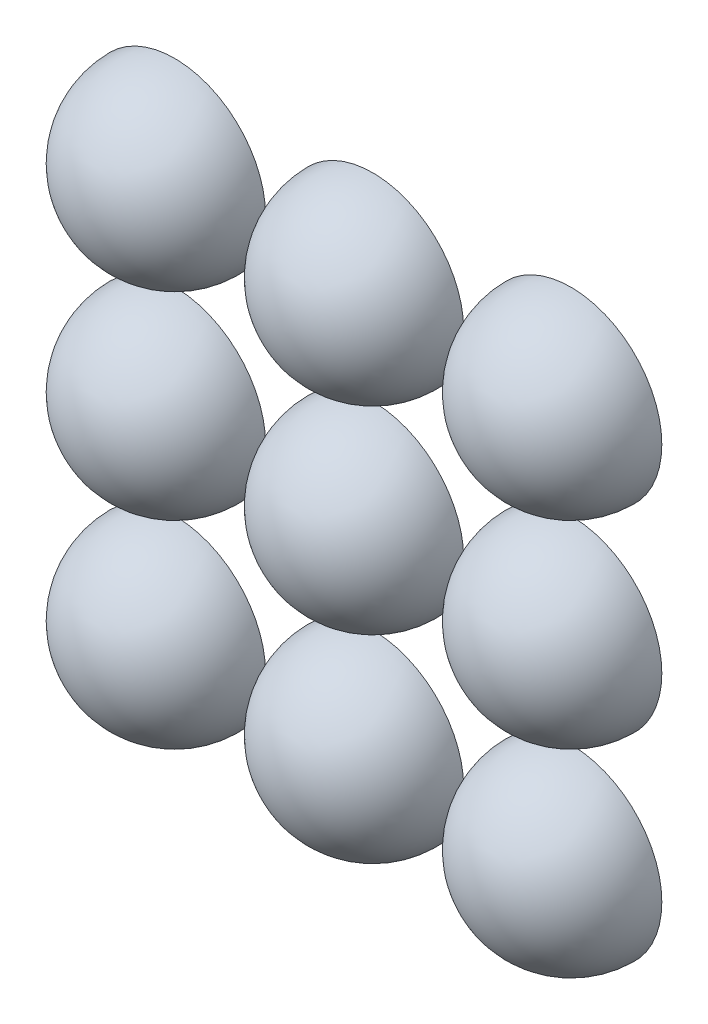
ISO-10303-21;
HEADER;
FILE_DESCRIPTION(('STEP AP214'),'2;1');
FILE_NAME('part.step','',(''),(''),'','','');
FILE_SCHEMA(('AUTOMOTIVE_DESIGN { 1 0 10303 214 1 1 1 1 }'));
ENDSEC;
DATA;
#1=APPLICATION_CONTEXT('core data for automotive mechanical design processes');
#2=APPLICATION_PROTOCOL_DEFINITION('international standard','automotive_design',2000,#1);
#3=PRODUCT_CONTEXT('',#1,'mechanical');
#4=PRODUCT('Part','Part','',(#3));
#5=PRODUCT_RELATED_PRODUCT_CATEGORY('part','',(#4));
#6=PRODUCT_DEFINITION_FORMATION('','',#4);
#7=PRODUCT_DEFINITION_CONTEXT('part definition',#1,'design');
#8=PRODUCT_DEFINITION('design','',#6,#7);
#9=PRODUCT_DEFINITION_SHAPE('','',#8);
#10=(LENGTH_UNIT() NAMED_UNIT(*) SI_UNIT(.MILLI.,.METRE.));
#11=(NAMED_UNIT(*) PLANE_ANGLE_UNIT() SI_UNIT($,.RADIAN.));
#12=(NAMED_UNIT(*) SI_UNIT($,.STERADIAN.) SOLID_ANGLE_UNIT());
#13=UNCERTAINTY_MEASURE_WITH_UNIT(LENGTH_MEASURE(1.E-05),#10,'distance_accuracy_value','');
#14=(GEOMETRIC_REPRESENTATION_CONTEXT(3) GLOBAL_UNCERTAINTY_ASSIGNED_CONTEXT((#13)) GLOBAL_UNIT_ASSIGNED_CONTEXT((#10,
#11,#12)) REPRESENTATION_CONTEXT('',''));
#15=CARTESIAN_POINT('',(0.,0.,0.));
#16=DIRECTION('',(0.,0.,1.));
#17=DIRECTION('',(1.,0.,0.));
#18=AXIS2_PLACEMENT_3D('',#15,#16,#17);
#19=CARTESIAN_POINT('',(-4.47594487294998,-6.71492943372793,10.));
#20=DIRECTION('',(-1.,0.,0.));
#21=DIRECTION('',(0.,0.,-1.));
#22=AXIS2_PLACEMENT_3D('',#19,#20,#21);
#23=SPHERICAL_SURFACE('',#22,3.01221410388678);
#24=CARTESIAN_POINT('',(-4.47594487294998,-6.71492943372793,10.));
#25=DIRECTION('',(0.,0.,1.));
#26=DIRECTION('',(1.,0.,0.));
#27=AXIS2_PLACEMENT_3D('',#24,#25,#26);
#28=SPHERICAL_SURFACE('',#27,3.01221410388678);
#29=CARTESIAN_POINT('',(-4.47594487294998,-6.71492943372793,9.99999999999999));
#30=DIRECTION('',(0.,0.,1.));
#31=DIRECTION('',(1.,0.,0.));
#32=AXIS2_PLACEMENT_3D('',#29,#30,#31);
#33=CIRCLE('',#32,3.01221410388678);
#34=CARTESIAN_POINT('',(-1.46373076906319,-6.71492943372793,9.99999999999999));
#35=VERTEX_POINT('',#34);
#36=EDGE_CURVE('E43',#35,#35,#33,.F.);
#37=ORIENTED_EDGE('',*,*,#36,.T.);
#38=EDGE_LOOP('',(#37));
#39=FACE_BOUND('',#38,.T.);
#40=ADVANCED_FACE('F39',(#39),#28,.F.);
#41=CARTESIAN_POINT('',(-24.5125871846065,37.9548929500776,9.99999999999999));
#42=DIRECTION('',(0.,0.,1.));
#43=DIRECTION('',(1.,0.,0.));
#44=AXIS2_PLACEMENT_3D('',#41,#42,#43);
#45=PLANE('',#44);
#46=ORIENTED_EDGE('',*,*,#36,.F.);
#47=EDGE_LOOP('',(#46));
#48=FACE_BOUND('',#47,.T.);
#49=CARTESIAN_POINT('',(-4.47594487294998,-6.71492943372793,9.99999999999999));
#50=DIRECTION('',(0.,0.,1.));
#51=DIRECTION('',(1.,0.,0.));
#52=AXIS2_PLACEMENT_3D('',#49,#50,#51);
#53=CIRCLE('',#52,3.21221410388678);
#54=CARTESIAN_POINT('',(-1.26373076906319,-6.71492943372793,9.99999999999999));
#55=VERTEX_POINT('',#54);
#56=EDGE_CURVE('E11',#55,#55,#53,.T.);
#57=ORIENTED_EDGE('',*,*,#56,.F.);
#58=EDGE_LOOP('',(#57));
#59=FACE_BOUND('',#58,.T.);
#60=ADVANCED_FACE('F41',(#48,#59),#45,.F.);
#61=CARTESIAN_POINT('',(-4.47594487294998,-6.71492943372793,10.));
#62=DIRECTION('',(-1.,0.,0.));
#63=DIRECTION('',(0.,0.,1.));
#64=AXIS2_PLACEMENT_3D('',#61,#62,#63);
#65=SPHERICAL_SURFACE('',#64,3.21221410388678);
#66=CARTESIAN_POINT('',(-4.47594487294998,-6.71492943372793,10.));
#67=DIRECTION('',(0.,0.,1.));
#68=DIRECTION('',(1.,0.,0.));
#69=AXIS2_PLACEMENT_3D('',#66,#67,#68);
#70=SPHERICAL_SURFACE('',#69,3.21221410388678);
#71=ORIENTED_EDGE('',*,*,#56,.T.);
#72=EDGE_LOOP('',(#71));
#73=FACE_BOUND('',#72,.T.);
#74=ADVANCED_FACE('F55',(#73),#70,.T.);
#75=CLOSED_SHELL('',(#40,#60,#74));
#76=MANIFOLD_SOLID_BREP('B2',#75);
#77=CARTESIAN_POINT('',(-4.47594487294998,0.285070566272073,10.));
#78=DIRECTION('',(-1.,0.,0.));
#79=DIRECTION('',(0.,0.,-1.));
#80=AXIS2_PLACEMENT_3D('',#77,#78,#79);
#81=SPHERICAL_SURFACE('',#80,3.01221410388678);
#82=CARTESIAN_POINT('',(-4.47594487294998,0.285070566272073,10.));
#83=DIRECTION('',(0.,0.,1.));
#84=DIRECTION('',(1.,0.,0.));
#85=AXIS2_PLACEMENT_3D('',#82,#83,#84);
#86=SPHERICAL_SURFACE('',#85,3.01221410388678);
#87=CARTESIAN_POINT('',(-4.47594487294998,0.285070566272073,9.99999999999999));
#88=DIRECTION('',(0.,0.,1.));
#89=DIRECTION('',(1.,0.,0.));
#90=AXIS2_PLACEMENT_3D('',#87,#88,#89);
#91=CIRCLE('',#90,3.01221410388678);
#92=CARTESIAN_POINT('',(-1.46373076906319,0.285070566272073,9.99999999999999));
#93=VERTEX_POINT('',#92);
#94=EDGE_CURVE('E91',#93,#93,#91,.F.);
#95=ORIENTED_EDGE('',*,*,#94,.T.);
#96=EDGE_LOOP('',(#95));
#97=FACE_BOUND('',#96,.T.);
#98=ADVANCED_FACE('F87',(#97),#86,.F.);
#99=CARTESIAN_POINT('',(-24.5125871846065,37.9548929500776,9.99999999999999));
#100=DIRECTION('',(0.,0.,1.));
#101=DIRECTION('',(1.,0.,0.));
#102=AXIS2_PLACEMENT_3D('',#99,#100,#101);
#103=PLANE('',#102);
#104=ORIENTED_EDGE('',*,*,#94,.F.);
#105=EDGE_LOOP('',(#104));
#106=FACE_BOUND('',#105,.T.);
#107=CARTESIAN_POINT('',(-4.47594487294998,0.285070566272073,9.99999999999999));
#108=DIRECTION('',(0.,0.,1.));
#109=DIRECTION('',(1.,0.,0.));
#110=AXIS2_PLACEMENT_3D('',#107,#108,#109);
#111=CIRCLE('',#110,3.21221410388678);
#112=CARTESIAN_POINT('',(-1.26373076906319,0.285070566272073,9.99999999999999));
#113=VERTEX_POINT('',#112);
#114=EDGE_CURVE('E38',#113,#113,#111,.T.);
#115=ORIENTED_EDGE('',*,*,#114,.F.);
#116=EDGE_LOOP('',(#115));
#117=FACE_BOUND('',#116,.T.);
#118=ADVANCED_FACE('F89',(#106,#117),#103,.F.);
#119=CARTESIAN_POINT('',(-4.47594487294998,0.285070566272073,10.));
#120=DIRECTION('',(-1.,0.,0.));
#121=DIRECTION('',(0.,0.,1.));
#122=AXIS2_PLACEMENT_3D('',#119,#120,#121);
#123=SPHERICAL_SURFACE('',#122,3.21221410388678);
#124=CARTESIAN_POINT('',(-4.47594487294998,0.285070566272073,10.));
#125=DIRECTION('',(0.,0.,1.));
#126=DIRECTION('',(1.,0.,0.));
#127=AXIS2_PLACEMENT_3D('',#124,#125,#126);
#128=SPHERICAL_SURFACE('',#127,3.21221410388678);
#129=ORIENTED_EDGE('',*,*,#114,.T.);
#130=EDGE_LOOP('',(#129));
#131=FACE_BOUND('',#130,.T.);
#132=ADVANCED_FACE('F103',(#131),#128,.T.);
#133=CLOSED_SHELL('',(#98,#118,#132));
#134=MANIFOLD_SOLID_BREP('B6',#133);
#135=CARTESIAN_POINT('',(-4.47594487294998,7.28507056627207,10.));
#136=DIRECTION('',(-1.,0.,0.));
#137=DIRECTION('',(0.,0.,-1.));
#138=AXIS2_PLACEMENT_3D('',#135,#136,#137);
#139=SPHERICAL_SURFACE('',#138,3.01221410388678);
#140=CARTESIAN_POINT('',(-4.47594487294998,7.28507056627207,10.));
#141=DIRECTION('',(0.,0.,1.));
#142=DIRECTION('',(1.,0.,0.));
#143=AXIS2_PLACEMENT_3D('',#140,#141,#142);
#144=SPHERICAL_SURFACE('',#143,3.01221410388678);
#145=CARTESIAN_POINT('',(-4.47594487294998,7.28507056627207,9.99999999999999));
#146=DIRECTION('',(0.,0.,1.));
#147=DIRECTION('',(1.,0.,0.));
#148=AXIS2_PLACEMENT_3D('',#145,#146,#147);
#149=CIRCLE('',#148,3.01221410388678);
#150=CARTESIAN_POINT('',(-1.46373076906319,7.28507056627207,9.99999999999999));
#151=VERTEX_POINT('',#150);
#152=EDGE_CURVE('E139',#151,#151,#149,.F.);
#153=ORIENTED_EDGE('',*,*,#152,.T.);
#154=EDGE_LOOP('',(#153));
#155=FACE_BOUND('',#154,.T.);
#156=ADVANCED_FACE('F135',(#155),#144,.F.);
#157=CARTESIAN_POINT('',(-24.5125871846065,37.9548929500776,9.99999999999999));
#158=DIRECTION('',(0.,0.,1.));
#159=DIRECTION('',(1.,0.,0.));
#160=AXIS2_PLACEMENT_3D('',#157,#158,#159);
#161=PLANE('',#160);
#162=ORIENTED_EDGE('',*,*,#152,.F.);
#163=EDGE_LOOP('',(#162));
#164=FACE_BOUND('',#163,.T.);
#165=CARTESIAN_POINT('',(-4.47594487294998,7.28507056627207,9.99999999999999));
#166=DIRECTION('',(0.,0.,1.));
#167=DIRECTION('',(1.,0.,0.));
#168=AXIS2_PLACEMENT_3D('',#165,#166,#167);
#169=CIRCLE('',#168,3.21221410388678);
#170=CARTESIAN_POINT('',(-1.26373076906319,7.28507056627207,9.99999999999999));
#171=VERTEX_POINT('',#170);
#172=EDGE_CURVE('E86',#171,#171,#169,.T.);
#173=ORIENTED_EDGE('',*,*,#172,.F.);
#174=EDGE_LOOP('',(#173));
#175=FACE_BOUND('',#174,.T.);
#176=ADVANCED_FACE('F137',(#164,#175),#161,.F.);
#177=CARTESIAN_POINT('',(-4.47594487294998,7.28507056627207,10.));
#178=DIRECTION('',(-1.,0.,0.));
#179=DIRECTION('',(0.,0.,1.));
#180=AXIS2_PLACEMENT_3D('',#177,#178,#179);
#181=SPHERICAL_SURFACE('',#180,3.21221410388678);
#182=CARTESIAN_POINT('',(-4.47594487294998,7.28507056627207,10.));
#183=DIRECTION('',(0.,0.,1.));
#184=DIRECTION('',(1.,0.,0.));
#185=AXIS2_PLACEMENT_3D('',#182,#183,#184);
#186=SPHERICAL_SURFACE('',#185,3.21221410388678);
#187=ORIENTED_EDGE('',*,*,#172,.T.);
#188=EDGE_LOOP('',(#187));
#189=FACE_BOUND('',#188,.T.);
#190=ADVANCED_FACE('F151',(#189),#186,.T.);
#191=CLOSED_SHELL('',(#156,#176,#190));
#192=MANIFOLD_SOLID_BREP('B33',#191);
#193=CARTESIAN_POINT('',(-11.47594487295,-6.71492943372793,10.));
#194=DIRECTION('',(-1.,0.,0.));
#195=DIRECTION('',(0.,0.,-1.));
#196=AXIS2_PLACEMENT_3D('',#193,#194,#195);
#197=SPHERICAL_SURFACE('',#196,3.01221410388678);
#198=CARTESIAN_POINT('',(-11.47594487295,-6.71492943372793,10.));
#199=DIRECTION('',(0.,0.,1.));
#200=DIRECTION('',(1.,0.,0.));
#201=AXIS2_PLACEMENT_3D('',#198,#199,#200);
#202=SPHERICAL_SURFACE('',#201,3.01221410388678);
#203=CARTESIAN_POINT('',(-11.47594487295,-6.71492943372793,9.99999999999999));
#204=DIRECTION('',(0.,0.,1.));
#205=DIRECTION('',(1.,0.,0.));
#206=AXIS2_PLACEMENT_3D('',#203,#204,#205);
#207=CIRCLE('',#206,3.01221410388678);
#208=CARTESIAN_POINT('',(-8.4637307690632,-6.71492943372793,9.99999999999999));
#209=VERTEX_POINT('',#208);
#210=EDGE_CURVE('E187',#209,#209,#207,.F.);
#211=ORIENTED_EDGE('',*,*,#210,.T.);
#212=EDGE_LOOP('',(#211));
#213=FACE_BOUND('',#212,.T.);
#214=ADVANCED_FACE('F183',(#213),#202,.F.);
#215=CARTESIAN_POINT('',(-24.5125871846065,37.9548929500776,9.99999999999999));
#216=DIRECTION('',(0.,0.,1.));
#217=DIRECTION('',(1.,0.,0.));
#218=AXIS2_PLACEMENT_3D('',#215,#216,#217);
#219=PLANE('',#218);
#220=ORIENTED_EDGE('',*,*,#210,.F.);
#221=EDGE_LOOP('',(#220));
#222=FACE_BOUND('',#221,.T.);
#223=CARTESIAN_POINT('',(-11.47594487295,-6.71492943372793,9.99999999999999));
#224=DIRECTION('',(0.,0.,1.));
#225=DIRECTION('',(1.,0.,0.));
#226=AXIS2_PLACEMENT_3D('',#223,#224,#225);
#227=CIRCLE('',#226,3.21221410388678);
#228=CARTESIAN_POINT('',(-8.2637307690632,-6.71492943372793,9.99999999999999));
#229=VERTEX_POINT('',#228);
#230=EDGE_CURVE('E134',#229,#229,#227,.T.);
#231=ORIENTED_EDGE('',*,*,#230,.F.);
#232=EDGE_LOOP('',(#231));
#233=FACE_BOUND('',#232,.T.);
#234=ADVANCED_FACE('F185',(#222,#233),#219,.F.);
#235=CARTESIAN_POINT('',(-11.47594487295,-6.71492943372793,10.));
#236=DIRECTION('',(-1.,0.,0.));
#237=DIRECTION('',(0.,0.,1.));
#238=AXIS2_PLACEMENT_3D('',#235,#236,#237);
#239=SPHERICAL_SURFACE('',#238,3.21221410388678);
#240=CARTESIAN_POINT('',(-11.47594487295,-6.71492943372793,10.));
#241=DIRECTION('',(0.,0.,1.));
#242=DIRECTION('',(1.,0.,0.));
#243=AXIS2_PLACEMENT_3D('',#240,#241,#242);
#244=SPHERICAL_SURFACE('',#243,3.21221410388678);
#245=ORIENTED_EDGE('',*,*,#230,.T.);
#246=EDGE_LOOP('',(#245));
#247=FACE_BOUND('',#246,.T.);
#248=ADVANCED_FACE('F199',(#247),#244,.T.);
#249=CLOSED_SHELL('',(#214,#234,#248));
#250=MANIFOLD_SOLID_BREP('B81',#249);
#251=CARTESIAN_POINT('',(-11.47594487295,0.285070566272073,10.));
#252=DIRECTION('',(-1.,0.,0.));
#253=DIRECTION('',(0.,0.,-1.));
#254=AXIS2_PLACEMENT_3D('',#251,#252,#253);
#255=SPHERICAL_SURFACE('',#254,3.01221410388678);
#256=CARTESIAN_POINT('',(-11.47594487295,0.285070566272073,10.));
#257=DIRECTION('',(0.,0.,1.));
#258=DIRECTION('',(1.,0.,0.));
#259=AXIS2_PLACEMENT_3D('',#256,#257,#258);
#260=SPHERICAL_SURFACE('',#259,3.01221410388678);
#261=CARTESIAN_POINT('',(-11.47594487295,0.285070566272073,9.99999999999999));
#262=DIRECTION('',(0.,0.,1.));
#263=DIRECTION('',(1.,0.,0.));
#264=AXIS2_PLACEMENT_3D('',#261,#262,#263);
#265=CIRCLE('',#264,3.01221410388678);
#266=CARTESIAN_POINT('',(-8.4637307690632,0.285070566272073,9.99999999999999));
#267=VERTEX_POINT('',#266);
#268=EDGE_CURVE('E235',#267,#267,#265,.F.);
#269=ORIENTED_EDGE('',*,*,#268,.T.);
#270=EDGE_LOOP('',(#269));
#271=FACE_BOUND('',#270,.T.);
#272=ADVANCED_FACE('F231',(#271),#260,.F.);
#273=CARTESIAN_POINT('',(-24.5125871846065,37.9548929500776,9.99999999999999));
#274=DIRECTION('',(0.,0.,1.));
#275=DIRECTION('',(1.,0.,0.));
#276=AXIS2_PLACEMENT_3D('',#273,#274,#275);
#277=PLANE('',#276);
#278=ORIENTED_EDGE('',*,*,#268,.F.);
#279=EDGE_LOOP('',(#278));
#280=FACE_BOUND('',#279,.T.);
#281=CARTESIAN_POINT('',(-11.47594487295,0.285070566272073,9.99999999999999));
#282=DIRECTION('',(0.,0.,1.));
#283=DIRECTION('',(1.,0.,0.));
#284=AXIS2_PLACEMENT_3D('',#281,#282,#283);
#285=CIRCLE('',#284,3.21221410388678);
#286=CARTESIAN_POINT('',(-8.2637307690632,0.285070566272073,9.99999999999999));
#287=VERTEX_POINT('',#286);
#288=EDGE_CURVE('E182',#287,#287,#285,.T.);
#289=ORIENTED_EDGE('',*,*,#288,.F.);
#290=EDGE_LOOP('',(#289));
#291=FACE_BOUND('',#290,.T.);
#292=ADVANCED_FACE('F233',(#280,#291),#277,.F.);
#293=CARTESIAN_POINT('',(-11.47594487295,0.285070566272073,10.));
#294=DIRECTION('',(-1.,0.,0.));
#295=DIRECTION('',(0.,0.,1.));
#296=AXIS2_PLACEMENT_3D('',#293,#294,#295);
#297=SPHERICAL_SURFACE('',#296,3.21221410388678);
#298=CARTESIAN_POINT('',(-11.47594487295,0.285070566272073,10.));
#299=DIRECTION('',(0.,0.,1.));
#300=DIRECTION('',(1.,0.,0.));
#301=AXIS2_PLACEMENT_3D('',#298,#299,#300);
#302=SPHERICAL_SURFACE('',#301,3.21221410388678);
#303=ORIENTED_EDGE('',*,*,#288,.T.);
#304=EDGE_LOOP('',(#303));
#305=FACE_BOUND('',#304,.T.);
#306=ADVANCED_FACE('F247',(#305),#302,.T.);
#307=CLOSED_SHELL('',(#272,#292,#306));
#308=MANIFOLD_SOLID_BREP('B129',#307);
#309=CARTESIAN_POINT('',(-11.47594487295,7.28507056627207,10.));
#310=DIRECTION('',(-1.,0.,0.));
#311=DIRECTION('',(0.,0.,-1.));
#312=AXIS2_PLACEMENT_3D('',#309,#310,#311);
#313=SPHERICAL_SURFACE('',#312,3.01221410388678);
#314=CARTESIAN_POINT('',(-11.47594487295,7.28507056627207,10.));
#315=DIRECTION('',(0.,0.,1.));
#316=DIRECTION('',(1.,0.,0.));
#317=AXIS2_PLACEMENT_3D('',#314,#315,#316);
#318=SPHERICAL_SURFACE('',#317,3.01221410388678);
#319=CARTESIAN_POINT('',(-11.47594487295,7.28507056627207,9.99999999999999));
#320=DIRECTION('',(0.,0.,1.));
#321=DIRECTION('',(1.,0.,0.));
#322=AXIS2_PLACEMENT_3D('',#319,#320,#321);
#323=CIRCLE('',#322,3.01221410388678);
#324=CARTESIAN_POINT('',(-8.4637307690632,7.28507056627207,9.99999999999999));
#325=VERTEX_POINT('',#324);
#326=EDGE_CURVE('E283',#325,#325,#323,.F.);
#327=ORIENTED_EDGE('',*,*,#326,.T.);
#328=EDGE_LOOP('',(#327));
#329=FACE_BOUND('',#328,.T.);
#330=ADVANCED_FACE('F279',(#329),#318,.F.);
#331=CARTESIAN_POINT('',(-24.5125871846065,37.9548929500776,9.99999999999999));
#332=DIRECTION('',(0.,0.,1.));
#333=DIRECTION('',(1.,0.,0.));
#334=AXIS2_PLACEMENT_3D('',#331,#332,#333);
#335=PLANE('',#334);
#336=ORIENTED_EDGE('',*,*,#326,.F.);
#337=EDGE_LOOP('',(#336));
#338=FACE_BOUND('',#337,.T.);
#339=CARTESIAN_POINT('',(-11.47594487295,7.28507056627207,9.99999999999999));
#340=DIRECTION('',(0.,0.,1.));
#341=DIRECTION('',(1.,0.,0.));
#342=AXIS2_PLACEMENT_3D('',#339,#340,#341);
#343=CIRCLE('',#342,3.21221410388678);
#344=CARTESIAN_POINT('',(-8.2637307690632,7.28507056627207,9.99999999999999));
#345=VERTEX_POINT('',#344);
#346=EDGE_CURVE('E230',#345,#345,#343,.T.);
#347=ORIENTED_EDGE('',*,*,#346,.F.);
#348=EDGE_LOOP('',(#347));
#349=FACE_BOUND('',#348,.T.);
#350=ADVANCED_FACE('F281',(#338,#349),#335,.F.);
#351=CARTESIAN_POINT('',(-11.47594487295,7.28507056627207,10.));
#352=DIRECTION('',(-1.,0.,0.));
#353=DIRECTION('',(0.,0.,1.));
#354=AXIS2_PLACEMENT_3D('',#351,#352,#353);
#355=SPHERICAL_SURFACE('',#354,3.21221410388678);
#356=CARTESIAN_POINT('',(-11.47594487295,7.28507056627207,10.));
#357=DIRECTION('',(0.,0.,1.));
#358=DIRECTION('',(1.,0.,0.));
#359=AXIS2_PLACEMENT_3D('',#356,#357,#358);
#360=SPHERICAL_SURFACE('',#359,3.21221410388678);
#361=ORIENTED_EDGE('',*,*,#346,.T.);
#362=EDGE_LOOP('',(#361));
#363=FACE_BOUND('',#362,.T.);
#364=ADVANCED_FACE('F295',(#363),#360,.T.);
#365=CLOSED_SHELL('',(#330,#350,#364));
#366=MANIFOLD_SOLID_BREP('B177',#365);
#367=CARTESIAN_POINT('',(-18.47594487295,-6.71492943372793,10.));
#368=DIRECTION('',(-1.,0.,0.));
#369=DIRECTION('',(0.,0.,-1.));
#370=AXIS2_PLACEMENT_3D('',#367,#368,#369);
#371=SPHERICAL_SURFACE('',#370,3.01221410388678);
#372=CARTESIAN_POINT('',(-18.47594487295,-6.71492943372793,10.));
#373=DIRECTION('',(0.,0.,1.));
#374=DIRECTION('',(1.,0.,0.));
#375=AXIS2_PLACEMENT_3D('',#372,#373,#374);
#376=SPHERICAL_SURFACE('',#375,3.01221410388678);
#377=CARTESIAN_POINT('',(-18.47594487295,-6.71492943372793,9.99999999999999));
#378=DIRECTION('',(0.,0.,1.));
#379=DIRECTION('',(1.,0.,0.));
#380=AXIS2_PLACEMENT_3D('',#377,#378,#379);
#381=CIRCLE('',#380,3.01221410388678);
#382=CARTESIAN_POINT('',(-15.4637307690632,-6.71492943372793,9.99999999999999));
#383=VERTEX_POINT('',#382);
#384=EDGE_CURVE('E331',#383,#383,#381,.F.);
#385=ORIENTED_EDGE('',*,*,#384,.T.);
#386=EDGE_LOOP('',(#385));
#387=FACE_BOUND('',#386,.T.);
#388=ADVANCED_FACE('F327',(#387),#376,.F.);
#389=CARTESIAN_POINT('',(-24.5125871846065,37.9548929500776,9.99999999999999));
#390=DIRECTION('',(0.,0.,1.));
#391=DIRECTION('',(1.,0.,0.));
#392=AXIS2_PLACEMENT_3D('',#389,#390,#391);
#393=PLANE('',#392);
#394=ORIENTED_EDGE('',*,*,#384,.F.);
#395=EDGE_LOOP('',(#394));
#396=FACE_BOUND('',#395,.T.);
#397=CARTESIAN_POINT('',(-18.47594487295,-6.71492943372793,9.99999999999999));
#398=DIRECTION('',(0.,0.,1.));
#399=DIRECTION('',(1.,0.,0.));
#400=AXIS2_PLACEMENT_3D('',#397,#398,#399);
#401=CIRCLE('',#400,3.21221410388678);
#402=CARTESIAN_POINT('',(-15.2637307690632,-6.71492943372793,9.99999999999999));
#403=VERTEX_POINT('',#402);
#404=EDGE_CURVE('E278',#403,#403,#401,.T.);
#405=ORIENTED_EDGE('',*,*,#404,.F.);
#406=EDGE_LOOP('',(#405));
#407=FACE_BOUND('',#406,.T.);
#408=ADVANCED_FACE('F329',(#396,#407),#393,.F.);
#409=CARTESIAN_POINT('',(-18.47594487295,-6.71492943372793,10.));
#410=DIRECTION('',(-1.,0.,0.));
#411=DIRECTION('',(0.,0.,1.));
#412=AXIS2_PLACEMENT_3D('',#409,#410,#411);
#413=SPHERICAL_SURFACE('',#412,3.21221410388678);
#414=CARTESIAN_POINT('',(-18.47594487295,-6.71492943372793,10.));
#415=DIRECTION('',(0.,0.,1.));
#416=DIRECTION('',(1.,0.,0.));
#417=AXIS2_PLACEMENT_3D('',#414,#415,#416);
#418=SPHERICAL_SURFACE('',#417,3.21221410388678);
#419=ORIENTED_EDGE('',*,*,#404,.T.);
#420=EDGE_LOOP('',(#419));
#421=FACE_BOUND('',#420,.T.);
#422=ADVANCED_FACE('F343',(#421),#418,.T.);
#423=CLOSED_SHELL('',(#388,#408,#422));
#424=MANIFOLD_SOLID_BREP('B225',#423);
#425=CARTESIAN_POINT('',(-18.47594487295,0.285070566272073,10.));
#426=DIRECTION('',(-1.,0.,0.));
#427=DIRECTION('',(0.,0.,-1.));
#428=AXIS2_PLACEMENT_3D('',#425,#426,#427);
#429=SPHERICAL_SURFACE('',#428,3.01221410388678);
#430=CARTESIAN_POINT('',(-18.47594487295,0.285070566272073,10.));
#431=DIRECTION('',(0.,0.,1.));
#432=DIRECTION('',(1.,0.,0.));
#433=AXIS2_PLACEMENT_3D('',#430,#431,#432);
#434=SPHERICAL_SURFACE('',#433,3.01221410388678);
#435=CARTESIAN_POINT('',(-18.47594487295,0.285070566272073,9.99999999999999));
#436=DIRECTION('',(0.,0.,1.));
#437=DIRECTION('',(1.,0.,0.));
#438=AXIS2_PLACEMENT_3D('',#435,#436,#437);
#439=CIRCLE('',#438,3.01221410388678);
#440=CARTESIAN_POINT('',(-15.4637307690632,0.285070566272073,9.99999999999999));
#441=VERTEX_POINT('',#440);
#442=EDGE_CURVE('E378',#441,#441,#439,.F.);
#443=ORIENTED_EDGE('',*,*,#442,.T.);
#444=EDGE_LOOP('',(#443));
#445=FACE_BOUND('',#444,.T.);
#446=ADVANCED_FACE('F374',(#445),#434,.F.);
#447=CARTESIAN_POINT('',(-24.5125871846065,37.9548929500776,9.99999999999999));
#448=DIRECTION('',(0.,0.,1.));
#449=DIRECTION('',(1.,0.,0.));
#450=AXIS2_PLACEMENT_3D('',#447,#448,#449);
#451=PLANE('',#450);
#452=ORIENTED_EDGE('',*,*,#442,.F.);
#453=EDGE_LOOP('',(#452));
#454=FACE_BOUND('',#453,.T.);
#455=CARTESIAN_POINT('',(-18.47594487295,0.285070566272073,9.99999999999999));
#456=DIRECTION('',(0.,0.,1.));
#457=DIRECTION('',(1.,0.,0.));
#458=AXIS2_PLACEMENT_3D('',#455,#456,#457);
#459=CIRCLE('',#458,3.21221410388678);
#460=CARTESIAN_POINT('',(-15.2637307690632,0.285070566272073,9.99999999999999));
#461=VERTEX_POINT('',#460);
#462=EDGE_CURVE('E326',#461,#461,#459,.T.);
#463=ORIENTED_EDGE('',*,*,#462,.F.);
#464=EDGE_LOOP('',(#463));
#465=FACE_BOUND('',#464,.T.);
#466=ADVANCED_FACE('F376',(#454,#465),#451,.F.);
#467=CARTESIAN_POINT('',(-18.47594487295,0.285070566272073,10.));
#468=DIRECTION('',(-1.,0.,0.));
#469=DIRECTION('',(0.,0.,1.));
#470=AXIS2_PLACEMENT_3D('',#467,#468,#469);
#471=SPHERICAL_SURFACE('',#470,3.21221410388678);
#472=CARTESIAN_POINT('',(-18.47594487295,0.285070566272073,10.));
#473=DIRECTION('',(0.,0.,1.));
#474=DIRECTION('',(1.,0.,0.));
#475=AXIS2_PLACEMENT_3D('',#472,#473,#474);
#476=SPHERICAL_SURFACE('',#475,3.21221410388678);
#477=ORIENTED_EDGE('',*,*,#462,.T.);
#478=EDGE_LOOP('',(#477));
#479=FACE_BOUND('',#478,.T.);
#480=ADVANCED_FACE('F390',(#479),#476,.T.);
#481=CLOSED_SHELL('',(#446,#466,#480));
#482=MANIFOLD_SOLID_BREP('B273',#481);
#483=CARTESIAN_POINT('',(-18.47594487295,7.28507056627207,10.));
#484=DIRECTION('',(-1.,0.,0.));
#485=DIRECTION('',(0.,0.,-1.));
#486=AXIS2_PLACEMENT_3D('',#483,#484,#485);
#487=SPHERICAL_SURFACE('',#486,3.01221410388678);
#488=CARTESIAN_POINT('',(-18.47594487295,7.28507056627207,10.));
#489=DIRECTION('',(0.,0.,1.));
#490=DIRECTION('',(1.,0.,0.));
#491=AXIS2_PLACEMENT_3D('',#488,#489,#490);
#492=SPHERICAL_SURFACE('',#491,3.01221410388678);
#493=CARTESIAN_POINT('',(-18.47594487295,7.28507056627207,9.99999999999999));
#494=DIRECTION('',(0.,0.,1.));
#495=DIRECTION('',(1.,0.,0.));
#496=AXIS2_PLACEMENT_3D('',#493,#494,#495);
#497=CIRCLE('',#496,3.01221410388678);
#498=CARTESIAN_POINT('',(-15.4637307690632,7.28507056627207,9.99999999999999));
#499=VERTEX_POINT('',#498);
#500=EDGE_CURVE('E420',#499,#499,#497,.F.);
#501=ORIENTED_EDGE('',*,*,#500,.T.);
#502=EDGE_LOOP('',(#501));
#503=FACE_BOUND('',#502,.T.);
#504=ADVANCED_FACE('F414',(#503),#492,.F.);
#505=CARTESIAN_POINT('',(-24.5125871846065,37.9548929500776,9.99999999999999));
#506=DIRECTION('',(0.,0.,1.));
#507=DIRECTION('',(1.,0.,0.));
#508=AXIS2_PLACEMENT_3D('',#505,#506,#507);
#509=PLANE('',#508);
#510=ORIENTED_EDGE('',*,*,#500,.F.);
#511=EDGE_LOOP('',(#510));
#512=FACE_BOUND('',#511,.T.);
#513=CARTESIAN_POINT('',(-18.47594487295,7.28507056627207,9.99999999999999));
#514=DIRECTION('',(0.,0.,1.));
#515=DIRECTION('',(1.,0.,0.));
#516=AXIS2_PLACEMENT_3D('',#513,#514,#515);
#517=CIRCLE('',#516,3.21221410388678);
#518=CARTESIAN_POINT('',(-15.2637307690632,7.28507056627207,9.99999999999999));
#519=VERTEX_POINT('',#518);
#520=EDGE_CURVE('E373',#519,#519,#517,.T.);
#521=ORIENTED_EDGE('',*,*,#520,.F.);
#522=EDGE_LOOP('',(#521));
#523=FACE_BOUND('',#522,.T.);
#524=ADVANCED_FACE('F427',(#512,#523),#509,.F.);
#525=CARTESIAN_POINT('',(-18.47594487295,7.28507056627207,10.));
#526=DIRECTION('',(-1.,0.,0.));
#527=DIRECTION('',(0.,0.,1.));
#528=AXIS2_PLACEMENT_3D('',#525,#526,#527);
#529=SPHERICAL_SURFACE('',#528,3.21221410388678);
#530=CARTESIAN_POINT('',(-18.47594487295,7.28507056627207,10.));
#531=DIRECTION('',(0.,0.,1.));
#532=DIRECTION('',(1.,0.,0.));
#533=AXIS2_PLACEMENT_3D('',#530,#531,#532);
#534=SPHERICAL_SURFACE('',#533,3.21221410388678);
#535=ORIENTED_EDGE('',*,*,#520,.T.);
#536=EDGE_LOOP('',(#535));
#537=FACE_BOUND('',#536,.T.);
#538=ADVANCED_FACE('F430',(#537),#534,.T.);
#539=CLOSED_SHELL('',(#504,#524,#538));
#540=MANIFOLD_SOLID_BREP('B321',#539);
#541=ADVANCED_BREP_SHAPE_REPRESENTATION('',(#18,#76,#134,#192,#250,#308,#366,#424,#482,#540),#14);
#542=SHAPE_DEFINITION_REPRESENTATION(#9,#541);
ENDSEC;
END-ISO-10303-21;
